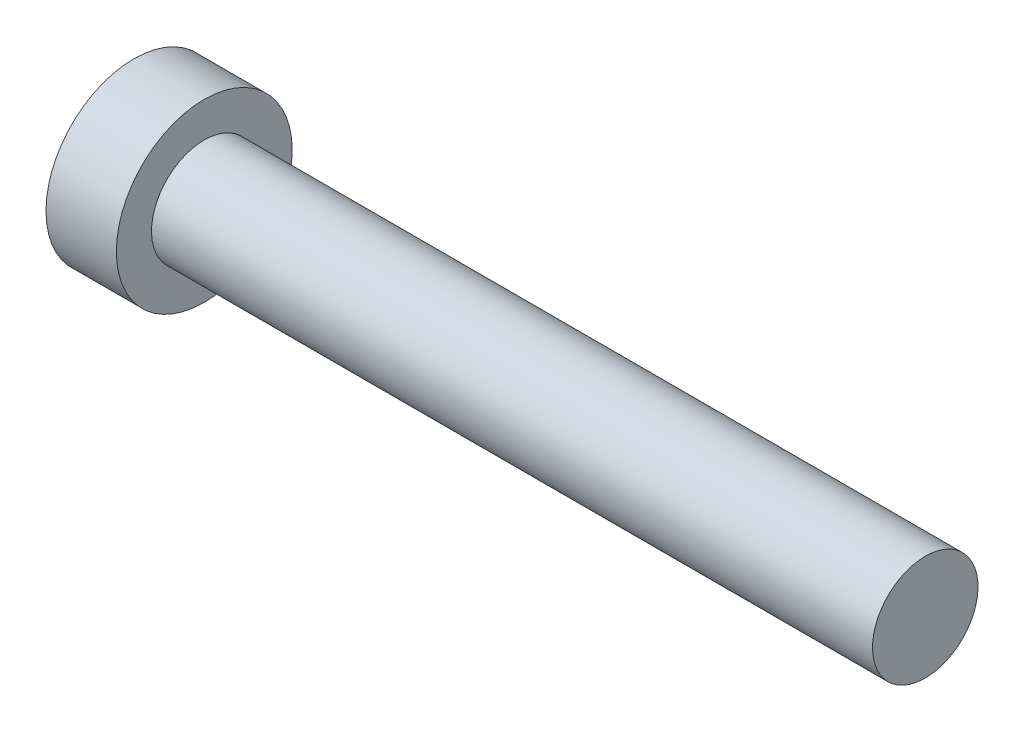
ISO-10303-21;
HEADER;
FILE_DESCRIPTION(('STEP AP214'),'2;1');
FILE_NAME('part.step','',(''),(''),'','','');
FILE_SCHEMA(('AUTOMOTIVE_DESIGN { 1 0 10303 214 1 1 1 1 }'));
ENDSEC;
DATA;
#1=APPLICATION_CONTEXT('core data for automotive mechanical design processes');
#2=APPLICATION_PROTOCOL_DEFINITION('international standard','automotive_design',2000,#1);
#3=PRODUCT_CONTEXT('',#1,'mechanical');
#4=PRODUCT('Part','Part','',(#3));
#5=PRODUCT_RELATED_PRODUCT_CATEGORY('part','',(#4));
#6=PRODUCT_DEFINITION_FORMATION('','',#4);
#7=PRODUCT_DEFINITION_CONTEXT('part definition',#1,'design');
#8=PRODUCT_DEFINITION('design','',#6,#7);
#9=PRODUCT_DEFINITION_SHAPE('','',#8);
#10=(LENGTH_UNIT() NAMED_UNIT(*) SI_UNIT(.MILLI.,.METRE.));
#11=(NAMED_UNIT(*) PLANE_ANGLE_UNIT() SI_UNIT($,.RADIAN.));
#12=(NAMED_UNIT(*) SI_UNIT($,.STERADIAN.) SOLID_ANGLE_UNIT());
#13=UNCERTAINTY_MEASURE_WITH_UNIT(LENGTH_MEASURE(1.E-05),#10,'distance_accuracy_value','');
#14=(GEOMETRIC_REPRESENTATION_CONTEXT(3) GLOBAL_UNCERTAINTY_ASSIGNED_CONTEXT((#13)) GLOBAL_UNIT_ASSIGNED_CONTEXT((#10,
#11,#12)) REPRESENTATION_CONTEXT('',''));
#15=CARTESIAN_POINT('',(0.,0.,0.));
#16=DIRECTION('',(0.,0.,1.));
#17=DIRECTION('',(1.,0.,0.));
#18=AXIS2_PLACEMENT_3D('',#15,#16,#17);
#19=CARTESIAN_POINT('',(0.,0.,0.));
#20=DIRECTION('',(-1.,0.,0.));
#21=DIRECTION('',(0.,-1.,0.));
#22=AXIS2_PLACEMENT_3D('',#19,#20,#21);
#23=PLANE('',#22);
#24=CARTESIAN_POINT('',(0.,0.,0.));
#25=DIRECTION('',(1.,0.,0.));
#26=DIRECTION('',(0.,1.,0.));
#27=AXIS2_PLACEMENT_3D('',#24,#25,#26);
#28=CIRCLE('',#27,5.);
#29=CARTESIAN_POINT('',(0.,5.,0.));
#30=VERTEX_POINT('',#29);
#31=EDGE_CURVE('E10',#30,#30,#28,.T.);
#32=ORIENTED_EDGE('',*,*,#31,.F.);
#33=EDGE_LOOP('',(#32));
#34=FACE_BOUND('',#33,.T.);
#35=ADVANCED_FACE('F30',(#34),#23,.T.);
#36=CARTESIAN_POINT('',(45.,0.,0.));
#37=DIRECTION('',(1.,0.,0.));
#38=DIRECTION('',(0.,1.,0.));
#39=AXIS2_PLACEMENT_3D('',#36,#37,#38);
#40=CYLINDRICAL_SURFACE('',#39,5.);
#41=ORIENTED_EDGE('',*,*,#31,.T.);
#42=EDGE_LOOP('',(#41));
#43=FACE_BOUND('',#42,.T.);
#44=CARTESIAN_POINT('',(4.,0.,0.));
#45=DIRECTION('',(1.,0.,0.));
#46=DIRECTION('',(0.,1.,0.));
#47=AXIS2_PLACEMENT_3D('',#44,#45,#46);
#48=CIRCLE('',#47,5.);
#49=CARTESIAN_POINT('',(4.,5.,0.));
#50=VERTEX_POINT('',#49);
#51=EDGE_CURVE('E36',#50,#50,#48,.T.);
#52=ORIENTED_EDGE('',*,*,#51,.F.);
#53=EDGE_LOOP('',(#52));
#54=FACE_BOUND('',#53,.T.);
#55=ADVANCED_FACE('F62',(#43,#54),#40,.T.);
#56=CARTESIAN_POINT('',(4.,5.,0.));
#57=DIRECTION('',(1.,0.,0.));
#58=DIRECTION('',(0.,1.,0.));
#59=AXIS2_PLACEMENT_3D('',#56,#57,#58);
#60=PLANE('',#59);
#61=ORIENTED_EDGE('',*,*,#51,.T.);
#62=EDGE_LOOP('',(#61));
#63=FACE_BOUND('',#62,.T.);
#64=CARTESIAN_POINT('',(4.,0.,0.));
#65=DIRECTION('',(1.,0.,0.));
#66=DIRECTION('',(0.,1.,0.));
#67=AXIS2_PLACEMENT_3D('',#64,#65,#66);
#68=CIRCLE('',#67,3.);
#69=CARTESIAN_POINT('',(4.,3.,0.));
#70=VERTEX_POINT('',#69);
#71=EDGE_CURVE('E40',#70,#70,#68,.T.);
#72=ORIENTED_EDGE('',*,*,#71,.F.);
#73=EDGE_LOOP('',(#72));
#74=FACE_BOUND('',#73,.T.);
#75=ADVANCED_FACE('F54',(#63,#74),#60,.T.);
#76=CARTESIAN_POINT('',(45.,0.,0.));
#77=DIRECTION('',(1.,0.,0.));
#78=DIRECTION('',(0.,1.,0.));
#79=AXIS2_PLACEMENT_3D('',#76,#77,#78);
#80=CYLINDRICAL_SURFACE('',#79,3.);
#81=ORIENTED_EDGE('',*,*,#71,.T.);
#82=EDGE_LOOP('',(#81));
#83=FACE_BOUND('',#82,.T.);
#84=CARTESIAN_POINT('',(45.,0.,0.));
#85=DIRECTION('',(1.,0.,0.));
#86=DIRECTION('',(0.,1.,0.));
#87=AXIS2_PLACEMENT_3D('',#84,#85,#86);
#88=CIRCLE('',#87,3.);
#89=CARTESIAN_POINT('',(45.,3.,0.));
#90=VERTEX_POINT('',#89);
#91=EDGE_CURVE('E44',#90,#90,#88,.T.);
#92=ORIENTED_EDGE('',*,*,#91,.F.);
#93=EDGE_LOOP('',(#92));
#94=FACE_BOUND('',#93,.T.);
#95=ADVANCED_FACE('F52',(#83,#94),#80,.T.);
#96=CARTESIAN_POINT('',(45.,3.,0.));
#97=DIRECTION('',(1.,0.,0.));
#98=DIRECTION('',(0.,1.,0.));
#99=AXIS2_PLACEMENT_3D('',#96,#97,#98);
#100=PLANE('',#99);
#101=ORIENTED_EDGE('',*,*,#91,.T.);
#102=EDGE_LOOP('',(#101));
#103=FACE_BOUND('',#102,.T.);
#104=ADVANCED_FACE('F50',(#103),#100,.T.);
#105=CLOSED_SHELL('',(#35,#55,#75,#95,#104));
#106=MANIFOLD_SOLID_BREP('B2',#105);
#107=ADVANCED_BREP_SHAPE_REPRESENTATION('',(#18,#106),#14);
#108=SHAPE_DEFINITION_REPRESENTATION(#9,#107);
ENDSEC;
END-ISO-10303-21;
